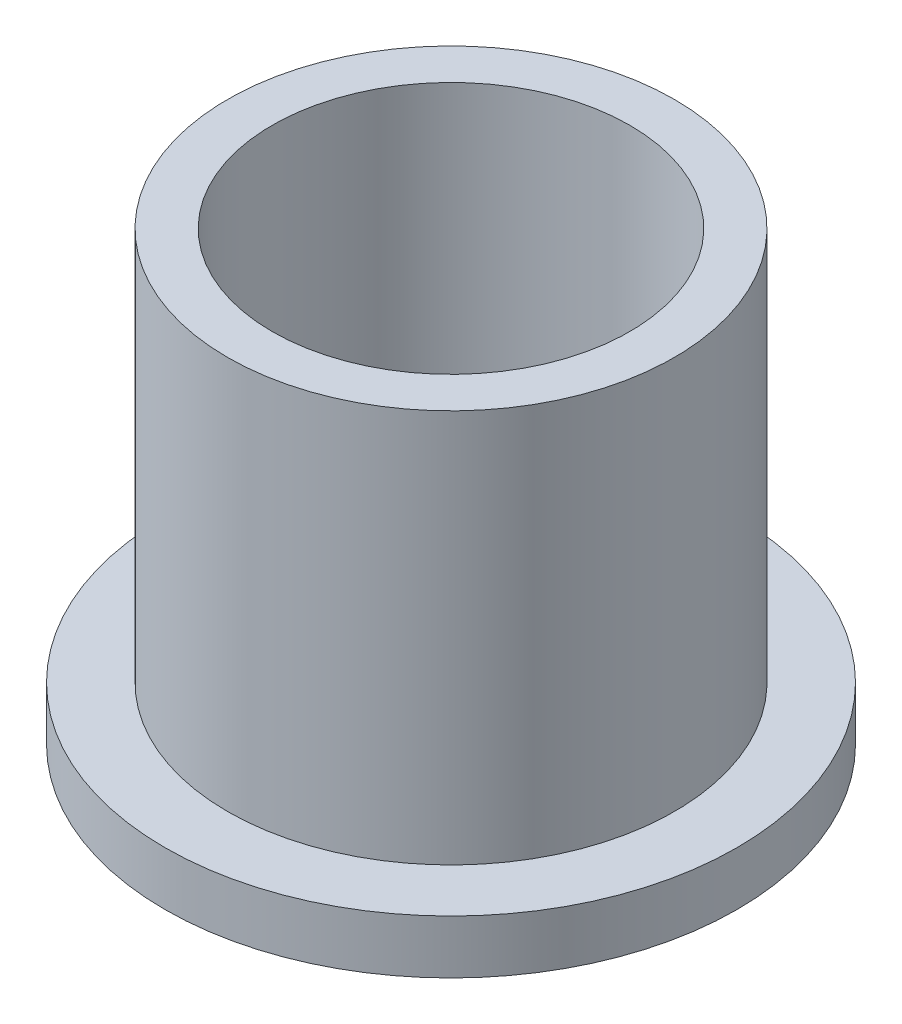
ISO-10303-21;
HEADER;
FILE_DESCRIPTION(('STEP AP214'),'2;1');
FILE_NAME('part.step','',(''),(''),'','','');
FILE_SCHEMA(('AUTOMOTIVE_DESIGN { 1 0 10303 214 1 1 1 1 }'));
ENDSEC;
DATA;
#1=APPLICATION_CONTEXT('core data for automotive mechanical design processes');
#2=APPLICATION_PROTOCOL_DEFINITION('international standard','automotive_design',2000,#1);
#3=PRODUCT_CONTEXT('',#1,'mechanical');
#4=PRODUCT('Part','Part','',(#3));
#5=PRODUCT_RELATED_PRODUCT_CATEGORY('part','',(#4));
#6=PRODUCT_DEFINITION_FORMATION('','',#4);
#7=PRODUCT_DEFINITION_CONTEXT('part definition',#1,'design');
#8=PRODUCT_DEFINITION('design','',#6,#7);
#9=PRODUCT_DEFINITION_SHAPE('','',#8);
#10=(LENGTH_UNIT() NAMED_UNIT(*) SI_UNIT(.MILLI.,.METRE.));
#11=(NAMED_UNIT(*) PLANE_ANGLE_UNIT() SI_UNIT($,.RADIAN.));
#12=(NAMED_UNIT(*) SI_UNIT($,.STERADIAN.) SOLID_ANGLE_UNIT());
#13=UNCERTAINTY_MEASURE_WITH_UNIT(LENGTH_MEASURE(1.E-05),#10,'distance_accuracy_value','');
#14=(GEOMETRIC_REPRESENTATION_CONTEXT(3) GLOBAL_UNCERTAINTY_ASSIGNED_CONTEXT((#13)) GLOBAL_UNIT_ASSIGNED_CONTEXT((#10,
#11,#12)) REPRESENTATION_CONTEXT('',''));
#15=CARTESIAN_POINT('',(0.,0.,0.));
#16=DIRECTION('',(0.,0.,1.));
#17=DIRECTION('',(1.,0.,0.));
#18=AXIS2_PLACEMENT_3D('',#15,#16,#17);
#19=CARTESIAN_POINT('',(0.,3.,0.));
#20=DIRECTION('',(0.,-1.,0.));
#21=DIRECTION('',(0.,0.,-1.));
#22=AXIS2_PLACEMENT_3D('',#19,#20,#21);
#23=CYLINDRICAL_SURFACE('',#22,16.);
#24=CARTESIAN_POINT('',(0.,3.,0.));
#25=DIRECTION('',(0.,1.,0.));
#26=DIRECTION('',(0.,0.,1.));
#27=AXIS2_PLACEMENT_3D('',#24,#25,#26);
#28=CIRCLE('',#27,16.);
#29=CARTESIAN_POINT('',(0.,3.,16.));
#30=VERTEX_POINT('',#29);
#31=EDGE_CURVE('E11',#30,#30,#28,.T.);
#32=ORIENTED_EDGE('',*,*,#31,.F.);
#33=EDGE_LOOP('',(#32));
#34=FACE_BOUND('',#33,.T.);
#35=CARTESIAN_POINT('',(0.,0.,0.));
#36=DIRECTION('',(0.,1.,0.));
#37=DIRECTION('',(0.,0.,1.));
#38=AXIS2_PLACEMENT_3D('',#35,#36,#37);
#39=CIRCLE('',#38,16.);
#40=CARTESIAN_POINT('',(0.,0.,16.));
#41=VERTEX_POINT('',#40);
#42=EDGE_CURVE('E37',#41,#41,#39,.T.);
#43=ORIENTED_EDGE('',*,*,#42,.T.);
#44=EDGE_LOOP('',(#43));
#45=FACE_BOUND('',#44,.T.);
#46=ADVANCED_FACE('F34',(#34,#45),#23,.T.);
#47=CARTESIAN_POINT('',(0.,3.,0.));
#48=DIRECTION('',(0.,1.,0.));
#49=DIRECTION('',(0.,0.,1.));
#50=AXIS2_PLACEMENT_3D('',#47,#48,#49);
#51=PLANE('',#50);
#52=CARTESIAN_POINT('',(0.,3.,0.));
#53=DIRECTION('',(0.,-1.,0.));
#54=DIRECTION('',(0.,0.,-1.));
#55=AXIS2_PLACEMENT_3D('',#52,#53,#54);
#56=CIRCLE('',#55,12.5);
#57=CARTESIAN_POINT('',(0.,3.,-12.5));
#58=VERTEX_POINT('',#57);
#59=EDGE_CURVE('E48',#58,#58,#56,.T.);
#60=ORIENTED_EDGE('',*,*,#59,.T.);
#61=EDGE_LOOP('',(#60));
#62=FACE_BOUND('',#61,.T.);
#63=ORIENTED_EDGE('',*,*,#31,.T.);
#64=EDGE_LOOP('',(#63));
#65=FACE_BOUND('',#64,.T.);
#66=ADVANCED_FACE('F81',(#62,#65),#51,.T.);
#67=CARTESIAN_POINT('',(0.,0.,0.));
#68=DIRECTION('',(0.,1.,0.));
#69=DIRECTION('',(0.,0.,1.));
#70=AXIS2_PLACEMENT_3D('',#67,#68,#69);
#71=PLANE('',#70);
#72=CARTESIAN_POINT('',(0.,0.,0.));
#73=DIRECTION('',(0.,1.,0.));
#74=DIRECTION('',(0.,0.,1.));
#75=AXIS2_PLACEMENT_3D('',#72,#73,#74);
#76=CIRCLE('',#75,10.);
#77=CARTESIAN_POINT('',(0.,0.,10.));
#78=VERTEX_POINT('',#77);
#79=EDGE_CURVE('E54',#78,#78,#76,.T.);
#80=ORIENTED_EDGE('',*,*,#79,.T.);
#81=EDGE_LOOP('',(#80));
#82=FACE_BOUND('',#81,.T.);
#83=ORIENTED_EDGE('',*,*,#42,.F.);
#84=EDGE_LOOP('',(#83));
#85=FACE_BOUND('',#84,.T.);
#86=ADVANCED_FACE('F58',(#82,#85),#71,.F.);
#87=CARTESIAN_POINT('',(0.,25.,0.));
#88=DIRECTION('',(0.,1.,0.));
#89=DIRECTION('',(0.,0.,1.));
#90=AXIS2_PLACEMENT_3D('',#87,#88,#89);
#91=PLANE('',#90);
#92=CARTESIAN_POINT('',(0.,25.,0.));
#93=DIRECTION('',(0.,1.,0.));
#94=DIRECTION('',(0.,0.,1.));
#95=AXIS2_PLACEMENT_3D('',#92,#93,#94);
#96=CIRCLE('',#95,10.);
#97=CARTESIAN_POINT('',(0.,25.,10.));
#98=VERTEX_POINT('',#97);
#99=EDGE_CURVE('E51',#98,#98,#96,.T.);
#100=ORIENTED_EDGE('',*,*,#99,.F.);
#101=EDGE_LOOP('',(#100));
#102=FACE_BOUND('',#101,.T.);
#103=CARTESIAN_POINT('',(0.,25.,0.));
#104=DIRECTION('',(0.,-1.,0.));
#105=DIRECTION('',(0.,0.,-1.));
#106=AXIS2_PLACEMENT_3D('',#103,#104,#105);
#107=CIRCLE('',#106,12.5);
#108=CARTESIAN_POINT('',(0.,25.,-12.5));
#109=VERTEX_POINT('',#108);
#110=EDGE_CURVE('E44',#109,#109,#107,.T.);
#111=ORIENTED_EDGE('',*,*,#110,.F.);
#112=EDGE_LOOP('',(#111));
#113=FACE_BOUND('',#112,.T.);
#114=ADVANCED_FACE('F66',(#102,#113),#91,.T.);
#115=CARTESIAN_POINT('',(0.,3.,0.));
#116=DIRECTION('',(0.,1.,0.));
#117=DIRECTION('',(0.,0.,1.));
#118=AXIS2_PLACEMENT_3D('',#115,#116,#117);
#119=CYLINDRICAL_SURFACE('',#118,12.5);
#120=ORIENTED_EDGE('',*,*,#59,.F.);
#121=EDGE_LOOP('',(#120));
#122=FACE_BOUND('',#121,.T.);
#123=ORIENTED_EDGE('',*,*,#110,.T.);
#124=EDGE_LOOP('',(#123));
#125=FACE_BOUND('',#124,.T.);
#126=ADVANCED_FACE('F64',(#122,#125),#119,.T.);
#127=CARTESIAN_POINT('',(0.,0.,0.));
#128=DIRECTION('',(0.,1.,0.));
#129=DIRECTION('',(0.,0.,1.));
#130=AXIS2_PLACEMENT_3D('',#127,#128,#129);
#131=CYLINDRICAL_SURFACE('',#130,10.);
#132=ORIENTED_EDGE('',*,*,#79,.F.);
#133=EDGE_LOOP('',(#132));
#134=FACE_BOUND('',#133,.T.);
#135=ORIENTED_EDGE('',*,*,#99,.T.);
#136=EDGE_LOOP('',(#135));
#137=FACE_BOUND('',#136,.T.);
#138=ADVANCED_FACE('F61',(#134,#137),#131,.F.);
#139=CLOSED_SHELL('',(#46,#66,#86,#114,#126,#138));
#140=MANIFOLD_SOLID_BREP('B2',#139);
#141=ADVANCED_BREP_SHAPE_REPRESENTATION('',(#18,#140),#14);
#142=SHAPE_DEFINITION_REPRESENTATION(#9,#141);
ENDSEC;
END-ISO-10303-21;
